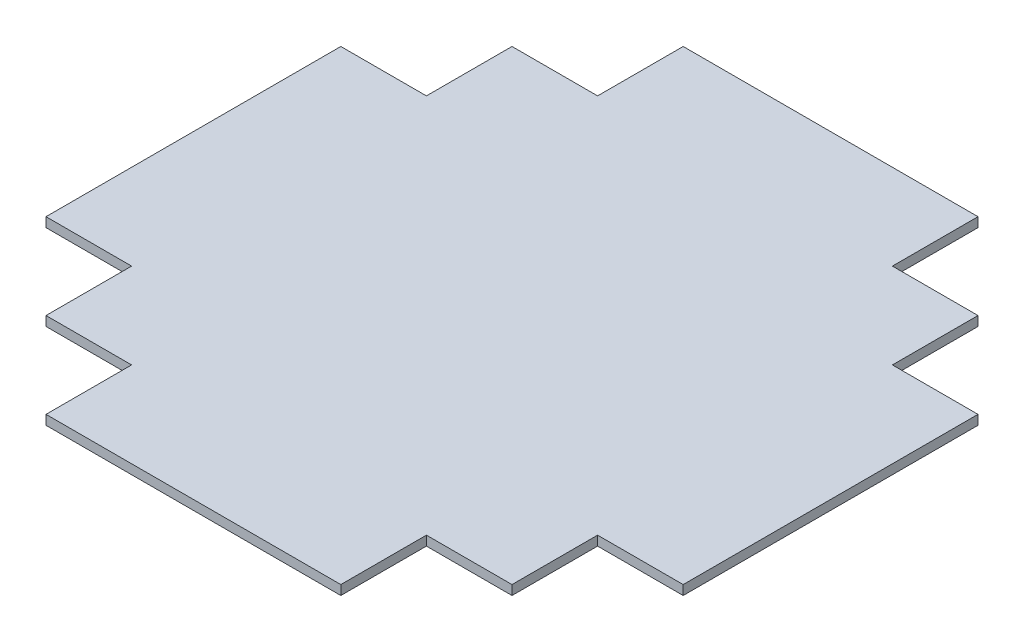
ISO-10303-21;
HEADER;
FILE_DESCRIPTION(('STEP AP214'),'2;1');
FILE_NAME('part.step','',(''),(''),'','','');
FILE_SCHEMA(('AUTOMOTIVE_DESIGN { 1 0 10303 214 1 1 1 1 }'));
ENDSEC;
DATA;
#1=APPLICATION_CONTEXT('core data for automotive mechanical design processes');
#2=APPLICATION_PROTOCOL_DEFINITION('international standard','automotive_design',2000,#1);
#3=PRODUCT_CONTEXT('',#1,'mechanical');
#4=PRODUCT('Part','Part','',(#3));
#5=PRODUCT_RELATED_PRODUCT_CATEGORY('part','',(#4));
#6=PRODUCT_DEFINITION_FORMATION('','',#4);
#7=PRODUCT_DEFINITION_CONTEXT('part definition',#1,'design');
#8=PRODUCT_DEFINITION('design','',#6,#7);
#9=PRODUCT_DEFINITION_SHAPE('','',#8);
#10=(LENGTH_UNIT() NAMED_UNIT(*) SI_UNIT(.MILLI.,.METRE.));
#11=(NAMED_UNIT(*) PLANE_ANGLE_UNIT() SI_UNIT($,.RADIAN.));
#12=(NAMED_UNIT(*) SI_UNIT($,.STERADIAN.) SOLID_ANGLE_UNIT());
#13=UNCERTAINTY_MEASURE_WITH_UNIT(LENGTH_MEASURE(1.E-05),#10,'distance_accuracy_value','');
#14=(GEOMETRIC_REPRESENTATION_CONTEXT(3) GLOBAL_UNCERTAINTY_ASSIGNED_CONTEXT((#13)) GLOBAL_UNIT_ASSIGNED_CONTEXT((#10,
#11,#12)) REPRESENTATION_CONTEXT('',''));
#15=CARTESIAN_POINT('',(0.,0.,0.));
#16=DIRECTION('',(0.,0.,1.));
#17=DIRECTION('',(1.,0.,0.));
#18=AXIS2_PLACEMENT_3D('',#15,#16,#17);
#19=CARTESIAN_POINT('',(-62.,2.,0.));
#20=DIRECTION('',(0.,0.,1.));
#21=DIRECTION('',(1.,0.,0.));
#22=AXIS2_PLACEMENT_3D('',#19,#20,#21);
#23=PLANE('',#22);
#24=DIRECTION('',(-1.,0.,0.));
#25=VECTOR('',#24,1.);
#26=CARTESIAN_POINT('',(-62.,0.,0.));
#27=LINE('',#26,#25);
#28=CARTESIAN_POINT('',(0.,0.,0.));
#29=VERTEX_POINT('',#28);
#30=CARTESIAN_POINT('',(-62.,0.,0.));
#31=VERTEX_POINT('',#30);
#32=EDGE_CURVE('E214',#29,#31,#27,.T.);
#33=ORIENTED_EDGE('',*,*,#32,.T.);
#34=DIRECTION('',(0.,-1.,0.));
#35=VECTOR('',#34,1.);
#36=CARTESIAN_POINT('',(-62.,2.,0.));
#37=LINE('',#36,#35);
#38=CARTESIAN_POINT('',(-62.,2.,0.));
#39=VERTEX_POINT('',#38);
#40=EDGE_CURVE('E11',#39,#31,#37,.T.);
#41=ORIENTED_EDGE('',*,*,#40,.F.);
#42=DIRECTION('',(-1.,0.,0.));
#43=VECTOR('',#42,1.);
#44=CARTESIAN_POINT('',(-62.,2.,0.));
#45=LINE('',#44,#43);
#46=CARTESIAN_POINT('',(0.,2.,0.));
#47=VERTEX_POINT('',#46);
#48=EDGE_CURVE('E272',#47,#39,#45,.T.);
#49=ORIENTED_EDGE('',*,*,#48,.F.);
#50=DIRECTION('',(0.,-1.,0.));
#51=VECTOR('',#50,1.);
#52=CARTESIAN_POINT('',(0.,2.,0.));
#53=LINE('',#52,#51);
#54=EDGE_CURVE('E210',#47,#29,#53,.T.);
#55=ORIENTED_EDGE('',*,*,#54,.T.);
#56=EDGE_LOOP('',(#33,#41,#49,#55));
#57=FACE_BOUND('',#56,.T.);
#58=ADVANCED_FACE('F41',(#57),#23,.F.);
#59=CARTESIAN_POINT('',(-62.,2.,0.));
#60=DIRECTION('',(1.,0.,0.));
#61=DIRECTION('',(0.,0.,-1.));
#62=AXIS2_PLACEMENT_3D('',#59,#60,#61);
#63=PLANE('',#62);
#64=DIRECTION('',(0.,0.,1.));
#65=VECTOR('',#64,1.);
#66=CARTESIAN_POINT('',(-62.,0.,0.));
#67=LINE('',#66,#65);
#68=CARTESIAN_POINT('',(-62.,0.,18.));
#69=VERTEX_POINT('',#68);
#70=EDGE_CURVE('E218',#31,#69,#67,.T.);
#71=ORIENTED_EDGE('',*,*,#70,.T.);
#72=DIRECTION('',(0.,-1.,0.));
#73=VECTOR('',#72,1.);
#74=CARTESIAN_POINT('',(-62.,2.,18.));
#75=LINE('',#74,#73);
#76=CARTESIAN_POINT('',(-62.,2.,18.));
#77=VERTEX_POINT('',#76);
#78=EDGE_CURVE('E50',#77,#69,#75,.T.);
#79=ORIENTED_EDGE('',*,*,#78,.F.);
#80=DIRECTION('',(0.,0.,1.));
#81=VECTOR('',#80,1.);
#82=CARTESIAN_POINT('',(-62.,2.,0.));
#83=LINE('',#82,#81);
#84=EDGE_CURVE('E137',#39,#77,#83,.T.);
#85=ORIENTED_EDGE('',*,*,#84,.F.);
#86=ORIENTED_EDGE('',*,*,#40,.T.);
#87=EDGE_LOOP('',(#71,#79,#85,#86));
#88=FACE_BOUND('',#87,.T.);
#89=ADVANCED_FACE('F422',(#88),#63,.F.);
#90=CARTESIAN_POINT('',(-62.,2.,18.));
#91=DIRECTION('',(0.,0.,1.));
#92=DIRECTION('',(1.,0.,0.));
#93=AXIS2_PLACEMENT_3D('',#90,#91,#92);
#94=PLANE('',#93);
#95=DIRECTION('',(-1.,0.,0.));
#96=VECTOR('',#95,1.);
#97=CARTESIAN_POINT('',(-62.,0.,18.));
#98=LINE('',#97,#96);
#99=CARTESIAN_POINT('',(-80.,0.,18.));
#100=VERTEX_POINT('',#99);
#101=EDGE_CURVE('E221',#69,#100,#98,.T.);
#102=ORIENTED_EDGE('',*,*,#101,.T.);
#103=DIRECTION('',(0.,-1.,0.));
#104=VECTOR('',#103,1.);
#105=CARTESIAN_POINT('',(-80.,2.,18.));
#106=LINE('',#105,#104);
#107=CARTESIAN_POINT('',(-80.,2.,18.));
#108=VERTEX_POINT('',#107);
#109=EDGE_CURVE('E331',#108,#100,#106,.T.);
#110=ORIENTED_EDGE('',*,*,#109,.F.);
#111=DIRECTION('',(-1.,0.,0.));
#112=VECTOR('',#111,1.);
#113=CARTESIAN_POINT('',(-62.,2.,18.));
#114=LINE('',#113,#112);
#115=EDGE_CURVE('E341',#77,#108,#114,.T.);
#116=ORIENTED_EDGE('',*,*,#115,.F.);
#117=ORIENTED_EDGE('',*,*,#78,.T.);
#118=EDGE_LOOP('',(#102,#110,#116,#117));
#119=FACE_BOUND('',#118,.T.);
#120=ADVANCED_FACE('F339',(#119),#94,.F.);
#121=CARTESIAN_POINT('',(-80.,2.,18.));
#122=DIRECTION('',(1.,0.,0.));
#123=DIRECTION('',(0.,0.,-1.));
#124=AXIS2_PLACEMENT_3D('',#121,#122,#123);
#125=PLANE('',#124);
#126=DIRECTION('',(0.,0.,1.));
#127=VECTOR('',#126,1.);
#128=CARTESIAN_POINT('',(-80.,0.,18.));
#129=LINE('',#128,#127);
#130=CARTESIAN_POINT('',(-80.,0.,36.));
#131=VERTEX_POINT('',#130);
#132=EDGE_CURVE('E224',#100,#131,#129,.T.);
#133=ORIENTED_EDGE('',*,*,#132,.T.);
#134=DIRECTION('',(0.,-1.,0.));
#135=VECTOR('',#134,1.);
#136=CARTESIAN_POINT('',(-80.,2.,36.));
#137=LINE('',#136,#135);
#138=CARTESIAN_POINT('',(-80.,2.,36.));
#139=VERTEX_POINT('',#138);
#140=EDGE_CURVE('E327',#139,#131,#137,.T.);
#141=ORIENTED_EDGE('',*,*,#140,.F.);
#142=DIRECTION('',(0.,0.,1.));
#143=VECTOR('',#142,1.);
#144=CARTESIAN_POINT('',(-80.,2.,18.));
#145=LINE('',#144,#143);
#146=EDGE_CURVE('E360',#108,#139,#145,.T.);
#147=ORIENTED_EDGE('',*,*,#146,.F.);
#148=ORIENTED_EDGE('',*,*,#109,.T.);
#149=EDGE_LOOP('',(#133,#141,#147,#148));
#150=FACE_BOUND('',#149,.T.);
#151=ADVANCED_FACE('F350',(#150),#125,.F.);
#152=CARTESIAN_POINT('',(-80.,2.,36.));
#153=DIRECTION('',(0.,0.,1.));
#154=DIRECTION('',(1.,0.,0.));
#155=AXIS2_PLACEMENT_3D('',#152,#153,#154);
#156=PLANE('',#155);
#157=DIRECTION('',(-1.,0.,0.));
#158=VECTOR('',#157,1.);
#159=CARTESIAN_POINT('',(-80.,0.,36.));
#160=LINE('',#159,#158);
#161=CARTESIAN_POINT('',(-98.,0.,36.));
#162=VERTEX_POINT('',#161);
#163=EDGE_CURVE('E227',#131,#162,#160,.T.);
#164=ORIENTED_EDGE('',*,*,#163,.T.);
#165=DIRECTION('',(0.,-1.,0.));
#166=VECTOR('',#165,1.);
#167=CARTESIAN_POINT('',(-98.,2.,36.));
#168=LINE('',#167,#166);
#169=CARTESIAN_POINT('',(-98.,2.,36.));
#170=VERTEX_POINT('',#169);
#171=EDGE_CURVE('E323',#170,#162,#168,.T.);
#172=ORIENTED_EDGE('',*,*,#171,.F.);
#173=DIRECTION('',(-1.,0.,0.));
#174=VECTOR('',#173,1.);
#175=CARTESIAN_POINT('',(-80.,2.,36.));
#176=LINE('',#175,#174);
#177=EDGE_CURVE('E356',#139,#170,#176,.T.);
#178=ORIENTED_EDGE('',*,*,#177,.F.);
#179=ORIENTED_EDGE('',*,*,#140,.T.);
#180=EDGE_LOOP('',(#164,#172,#178,#179));
#181=FACE_BOUND('',#180,.T.);
#182=ADVANCED_FACE('F354',(#181),#156,.F.);
#183=CARTESIAN_POINT('',(-98.,2.,36.));
#184=DIRECTION('',(1.,0.,0.));
#185=DIRECTION('',(0.,0.,-1.));
#186=AXIS2_PLACEMENT_3D('',#183,#184,#185);
#187=PLANE('',#186);
#188=DIRECTION('',(0.,0.,1.));
#189=VECTOR('',#188,1.);
#190=CARTESIAN_POINT('',(-98.,0.,36.));
#191=LINE('',#190,#189);
#192=CARTESIAN_POINT('',(-98.,0.,98.));
#193=VERTEX_POINT('',#192);
#194=EDGE_CURVE('E230',#162,#193,#191,.T.);
#195=ORIENTED_EDGE('',*,*,#194,.T.);
#196=DIRECTION('',(0.,-1.,0.));
#197=VECTOR('',#196,1.);
#198=CARTESIAN_POINT('',(-98.,2.,98.));
#199=LINE('',#198,#197);
#200=CARTESIAN_POINT('',(-98.,2.,98.));
#201=VERTEX_POINT('',#200);
#202=EDGE_CURVE('E319',#201,#193,#199,.T.);
#203=ORIENTED_EDGE('',*,*,#202,.F.);
#204=DIRECTION('',(0.,0.,1.));
#205=VECTOR('',#204,1.);
#206=CARTESIAN_POINT('',(-98.,2.,36.));
#207=LINE('',#206,#205);
#208=EDGE_CURVE('E359',#170,#201,#207,.T.);
#209=ORIENTED_EDGE('',*,*,#208,.F.);
#210=ORIENTED_EDGE('',*,*,#171,.T.);
#211=EDGE_LOOP('',(#195,#203,#209,#210));
#212=FACE_BOUND('',#211,.T.);
#213=ADVANCED_FACE('F435',(#212),#187,.F.);
#214=CARTESIAN_POINT('',(-98.,2.,98.));
#215=DIRECTION('',(0.,0.,-1.));
#216=DIRECTION('',(-1.,0.,0.));
#217=AXIS2_PLACEMENT_3D('',#214,#215,#216);
#218=PLANE('',#217);
#219=DIRECTION('',(1.,0.,0.));
#220=VECTOR('',#219,1.);
#221=CARTESIAN_POINT('',(-98.,0.,98.));
#222=LINE('',#221,#220);
#223=CARTESIAN_POINT('',(-80.,0.,98.));
#224=VERTEX_POINT('',#223);
#225=EDGE_CURVE('E233',#193,#224,#222,.T.);
#226=ORIENTED_EDGE('',*,*,#225,.T.);
#227=DIRECTION('',(0.,-1.,0.));
#228=VECTOR('',#227,1.);
#229=CARTESIAN_POINT('',(-80.,2.,98.));
#230=LINE('',#229,#228);
#231=CARTESIAN_POINT('',(-80.,2.,98.));
#232=VERTEX_POINT('',#231);
#233=EDGE_CURVE('E315',#232,#224,#230,.T.);
#234=ORIENTED_EDGE('',*,*,#233,.F.);
#235=DIRECTION('',(1.,0.,0.));
#236=VECTOR('',#235,1.);
#237=CARTESIAN_POINT('',(-98.,2.,98.));
#238=LINE('',#237,#236);
#239=EDGE_CURVE('E364',#201,#232,#238,.T.);
#240=ORIENTED_EDGE('',*,*,#239,.F.);
#241=ORIENTED_EDGE('',*,*,#202,.T.);
#242=EDGE_LOOP('',(#226,#234,#240,#241));
#243=FACE_BOUND('',#242,.T.);
#244=ADVANCED_FACE('F438',(#243),#218,.F.);
#245=CARTESIAN_POINT('',(-80.,2.,98.));
#246=DIRECTION('',(1.,0.,0.));
#247=DIRECTION('',(0.,0.,-1.));
#248=AXIS2_PLACEMENT_3D('',#245,#246,#247);
#249=PLANE('',#248);
#250=DIRECTION('',(0.,0.,1.));
#251=VECTOR('',#250,1.);
#252=CARTESIAN_POINT('',(-80.,0.,98.));
#253=LINE('',#252,#251);
#254=CARTESIAN_POINT('',(-80.,0.,116.));
#255=VERTEX_POINT('',#254);
#256=EDGE_CURVE('E236',#224,#255,#253,.T.);
#257=ORIENTED_EDGE('',*,*,#256,.T.);
#258=DIRECTION('',(0.,-1.,0.));
#259=VECTOR('',#258,1.);
#260=CARTESIAN_POINT('',(-80.,2.,116.));
#261=LINE('',#260,#259);
#262=CARTESIAN_POINT('',(-80.,2.,116.));
#263=VERTEX_POINT('',#262);
#264=EDGE_CURVE('E311',#263,#255,#261,.T.);
#265=ORIENTED_EDGE('',*,*,#264,.F.);
#266=DIRECTION('',(0.,0.,1.));
#267=VECTOR('',#266,1.);
#268=CARTESIAN_POINT('',(-80.,2.,98.));
#269=LINE('',#268,#267);
#270=EDGE_CURVE('E371',#232,#263,#269,.T.);
#271=ORIENTED_EDGE('',*,*,#270,.F.);
#272=ORIENTED_EDGE('',*,*,#233,.T.);
#273=EDGE_LOOP('',(#257,#265,#271,#272));
#274=FACE_BOUND('',#273,.T.);
#275=ADVANCED_FACE('F442',(#274),#249,.F.);
#276=CARTESIAN_POINT('',(-80.,2.,116.));
#277=DIRECTION('',(0.,0.,-1.));
#278=DIRECTION('',(-1.,0.,0.));
#279=AXIS2_PLACEMENT_3D('',#276,#277,#278);
#280=PLANE('',#279);
#281=DIRECTION('',(1.,0.,0.));
#282=VECTOR('',#281,1.);
#283=CARTESIAN_POINT('',(-80.,0.,116.));
#284=LINE('',#283,#282);
#285=CARTESIAN_POINT('',(-62.,0.,116.));
#286=VERTEX_POINT('',#285);
#287=EDGE_CURVE('E239',#255,#286,#284,.T.);
#288=ORIENTED_EDGE('',*,*,#287,.T.);
#289=DIRECTION('',(0.,-1.,0.));
#290=VECTOR('',#289,1.);
#291=CARTESIAN_POINT('',(-62.,2.,116.));
#292=LINE('',#291,#290);
#293=CARTESIAN_POINT('',(-62.,2.,116.));
#294=VERTEX_POINT('',#293);
#295=EDGE_CURVE('E307',#294,#286,#292,.T.);
#296=ORIENTED_EDGE('',*,*,#295,.F.);
#297=DIRECTION('',(1.,0.,0.));
#298=VECTOR('',#297,1.);
#299=CARTESIAN_POINT('',(-80.,2.,116.));
#300=LINE('',#299,#298);
#301=EDGE_CURVE('E374',#263,#294,#300,.T.);
#302=ORIENTED_EDGE('',*,*,#301,.F.);
#303=ORIENTED_EDGE('',*,*,#264,.T.);
#304=EDGE_LOOP('',(#288,#296,#302,#303));
#305=FACE_BOUND('',#304,.T.);
#306=ADVANCED_FACE('F446',(#305),#280,.F.);
#307=CARTESIAN_POINT('',(-62.,2.,116.));
#308=DIRECTION('',(1.,0.,0.));
#309=DIRECTION('',(0.,0.,-1.));
#310=AXIS2_PLACEMENT_3D('',#307,#308,#309);
#311=PLANE('',#310);
#312=DIRECTION('',(0.,0.,1.));
#313=VECTOR('',#312,1.);
#314=CARTESIAN_POINT('',(-62.,0.,116.));
#315=LINE('',#314,#313);
#316=CARTESIAN_POINT('',(-62.,0.,134.));
#317=VERTEX_POINT('',#316);
#318=EDGE_CURVE('E242',#286,#317,#315,.T.);
#319=ORIENTED_EDGE('',*,*,#318,.T.);
#320=DIRECTION('',(0.,-1.,0.));
#321=VECTOR('',#320,1.);
#322=CARTESIAN_POINT('',(-62.,2.,134.));
#323=LINE('',#322,#321);
#324=CARTESIAN_POINT('',(-62.,2.,134.));
#325=VERTEX_POINT('',#324);
#326=EDGE_CURVE('E303',#325,#317,#323,.T.);
#327=ORIENTED_EDGE('',*,*,#326,.F.);
#328=DIRECTION('',(0.,0.,1.));
#329=VECTOR('',#328,1.);
#330=CARTESIAN_POINT('',(-62.,2.,116.));
#331=LINE('',#330,#329);
#332=EDGE_CURVE('E377',#294,#325,#331,.T.);
#333=ORIENTED_EDGE('',*,*,#332,.F.);
#334=ORIENTED_EDGE('',*,*,#295,.T.);
#335=EDGE_LOOP('',(#319,#327,#333,#334));
#336=FACE_BOUND('',#335,.T.);
#337=ADVANCED_FACE('F450',(#336),#311,.F.);
#338=CARTESIAN_POINT('',(-62.,2.,134.));
#339=DIRECTION('',(0.,0.,-1.));
#340=DIRECTION('',(-1.,0.,0.));
#341=AXIS2_PLACEMENT_3D('',#338,#339,#340);
#342=PLANE('',#341);
#343=DIRECTION('',(1.,0.,0.));
#344=VECTOR('',#343,1.);
#345=CARTESIAN_POINT('',(-62.,0.,134.));
#346=LINE('',#345,#344);
#347=CARTESIAN_POINT('',(0.,0.,134.));
#348=VERTEX_POINT('',#347);
#349=EDGE_CURVE('E245',#317,#348,#346,.T.);
#350=ORIENTED_EDGE('',*,*,#349,.T.);
#351=DIRECTION('',(0.,-1.,0.));
#352=VECTOR('',#351,1.);
#353=CARTESIAN_POINT('',(0.,2.,134.));
#354=LINE('',#353,#352);
#355=CARTESIAN_POINT('',(0.,2.,134.));
#356=VERTEX_POINT('',#355);
#357=EDGE_CURVE('E299',#356,#348,#354,.T.);
#358=ORIENTED_EDGE('',*,*,#357,.F.);
#359=DIRECTION('',(1.,0.,0.));
#360=VECTOR('',#359,1.);
#361=CARTESIAN_POINT('',(-62.,2.,134.));
#362=LINE('',#361,#360);
#363=EDGE_CURVE('E380',#325,#356,#362,.T.);
#364=ORIENTED_EDGE('',*,*,#363,.F.);
#365=ORIENTED_EDGE('',*,*,#326,.T.);
#366=EDGE_LOOP('',(#350,#358,#364,#365));
#367=FACE_BOUND('',#366,.T.);
#368=ADVANCED_FACE('F454',(#367),#342,.F.);
#369=CARTESIAN_POINT('',(0.,2.,134.));
#370=DIRECTION('',(-1.,0.,0.));
#371=DIRECTION('',(0.,0.,1.));
#372=AXIS2_PLACEMENT_3D('',#369,#370,#371);
#373=PLANE('',#372);
#374=DIRECTION('',(0.,0.,-1.));
#375=VECTOR('',#374,1.);
#376=CARTESIAN_POINT('',(0.,0.,134.));
#377=LINE('',#376,#375);
#378=CARTESIAN_POINT('',(0.,0.,116.));
#379=VERTEX_POINT('',#378);
#380=EDGE_CURVE('E248',#348,#379,#377,.T.);
#381=ORIENTED_EDGE('',*,*,#380,.T.);
#382=DIRECTION('',(0.,-1.,0.));
#383=VECTOR('',#382,1.);
#384=CARTESIAN_POINT('',(0.,2.,116.));
#385=LINE('',#384,#383);
#386=CARTESIAN_POINT('',(0.,2.,116.));
#387=VERTEX_POINT('',#386);
#388=EDGE_CURVE('E295',#387,#379,#385,.T.);
#389=ORIENTED_EDGE('',*,*,#388,.F.);
#390=DIRECTION('',(0.,0.,-1.));
#391=VECTOR('',#390,1.);
#392=CARTESIAN_POINT('',(0.,2.,134.));
#393=LINE('',#392,#391);
#394=EDGE_CURVE('E383',#356,#387,#393,.T.);
#395=ORIENTED_EDGE('',*,*,#394,.F.);
#396=ORIENTED_EDGE('',*,*,#357,.T.);
#397=EDGE_LOOP('',(#381,#389,#395,#396));
#398=FACE_BOUND('',#397,.T.);
#399=ADVANCED_FACE('F458',(#398),#373,.F.);
#400=CARTESIAN_POINT('',(0.,2.,116.));
#401=DIRECTION('',(0.,0.,-1.));
#402=DIRECTION('',(-1.,0.,0.));
#403=AXIS2_PLACEMENT_3D('',#400,#401,#402);
#404=PLANE('',#403);
#405=DIRECTION('',(1.,0.,0.));
#406=VECTOR('',#405,1.);
#407=CARTESIAN_POINT('',(0.,0.,116.));
#408=LINE('',#407,#406);
#409=CARTESIAN_POINT('',(18.,0.,116.));
#410=VERTEX_POINT('',#409);
#411=EDGE_CURVE('E251',#379,#410,#408,.T.);
#412=ORIENTED_EDGE('',*,*,#411,.T.);
#413=DIRECTION('',(0.,-1.,0.));
#414=VECTOR('',#413,1.);
#415=CARTESIAN_POINT('',(18.,2.,116.));
#416=LINE('',#415,#414);
#417=CARTESIAN_POINT('',(18.,2.,116.));
#418=VERTEX_POINT('',#417);
#419=EDGE_CURVE('E291',#418,#410,#416,.T.);
#420=ORIENTED_EDGE('',*,*,#419,.F.);
#421=DIRECTION('',(1.,0.,0.));
#422=VECTOR('',#421,1.);
#423=CARTESIAN_POINT('',(0.,2.,116.));
#424=LINE('',#423,#422);
#425=EDGE_CURVE('E386',#387,#418,#424,.T.);
#426=ORIENTED_EDGE('',*,*,#425,.F.);
#427=ORIENTED_EDGE('',*,*,#388,.T.);
#428=EDGE_LOOP('',(#412,#420,#426,#427));
#429=FACE_BOUND('',#428,.T.);
#430=ADVANCED_FACE('F462',(#429),#404,.F.);
#431=CARTESIAN_POINT('',(18.,2.,116.));
#432=DIRECTION('',(-1.,0.,0.));
#433=DIRECTION('',(0.,0.,1.));
#434=AXIS2_PLACEMENT_3D('',#431,#432,#433);
#435=PLANE('',#434);
#436=DIRECTION('',(0.,0.,-1.));
#437=VECTOR('',#436,1.);
#438=CARTESIAN_POINT('',(18.,0.,116.));
#439=LINE('',#438,#437);
#440=CARTESIAN_POINT('',(18.,0.,98.));
#441=VERTEX_POINT('',#440);
#442=EDGE_CURVE('E254',#410,#441,#439,.T.);
#443=ORIENTED_EDGE('',*,*,#442,.T.);
#444=DIRECTION('',(0.,-1.,0.));
#445=VECTOR('',#444,1.);
#446=CARTESIAN_POINT('',(18.,2.,98.));
#447=LINE('',#446,#445);
#448=CARTESIAN_POINT('',(18.,2.,98.));
#449=VERTEX_POINT('',#448);
#450=EDGE_CURVE('E287',#449,#441,#447,.T.);
#451=ORIENTED_EDGE('',*,*,#450,.F.);
#452=DIRECTION('',(0.,0.,-1.));
#453=VECTOR('',#452,1.);
#454=CARTESIAN_POINT('',(18.,2.,116.));
#455=LINE('',#454,#453);
#456=EDGE_CURVE('E389',#418,#449,#455,.T.);
#457=ORIENTED_EDGE('',*,*,#456,.F.);
#458=ORIENTED_EDGE('',*,*,#419,.T.);
#459=EDGE_LOOP('',(#443,#451,#457,#458));
#460=FACE_BOUND('',#459,.T.);
#461=ADVANCED_FACE('F466',(#460),#435,.F.);
#462=CARTESIAN_POINT('',(18.,2.,98.));
#463=DIRECTION('',(0.,0.,-1.));
#464=DIRECTION('',(-1.,0.,0.));
#465=AXIS2_PLACEMENT_3D('',#462,#463,#464);
#466=PLANE('',#465);
#467=DIRECTION('',(1.,0.,0.));
#468=VECTOR('',#467,1.);
#469=CARTESIAN_POINT('',(18.,0.,98.));
#470=LINE('',#469,#468);
#471=CARTESIAN_POINT('',(36.,0.,98.));
#472=VERTEX_POINT('',#471);
#473=EDGE_CURVE('E257',#441,#472,#470,.T.);
#474=ORIENTED_EDGE('',*,*,#473,.T.);
#475=DIRECTION('',(0.,-1.,0.));
#476=VECTOR('',#475,1.);
#477=CARTESIAN_POINT('',(36.,2.,98.));
#478=LINE('',#477,#476);
#479=CARTESIAN_POINT('',(36.,2.,98.));
#480=VERTEX_POINT('',#479);
#481=EDGE_CURVE('E283',#480,#472,#478,.T.);
#482=ORIENTED_EDGE('',*,*,#481,.F.);
#483=DIRECTION('',(1.,0.,0.));
#484=VECTOR('',#483,1.);
#485=CARTESIAN_POINT('',(18.,2.,98.));
#486=LINE('',#485,#484);
#487=EDGE_CURVE('E392',#449,#480,#486,.T.);
#488=ORIENTED_EDGE('',*,*,#487,.F.);
#489=ORIENTED_EDGE('',*,*,#450,.T.);
#490=EDGE_LOOP('',(#474,#482,#488,#489));
#491=FACE_BOUND('',#490,.T.);
#492=ADVANCED_FACE('F470',(#491),#466,.F.);
#493=CARTESIAN_POINT('',(36.,2.,98.));
#494=DIRECTION('',(-1.,0.,0.));
#495=DIRECTION('',(0.,0.,1.));
#496=AXIS2_PLACEMENT_3D('',#493,#494,#495);
#497=PLANE('',#496);
#498=DIRECTION('',(0.,0.,-1.));
#499=VECTOR('',#498,1.);
#500=CARTESIAN_POINT('',(36.,0.,98.));
#501=LINE('',#500,#499);
#502=CARTESIAN_POINT('',(36.,0.,36.));
#503=VERTEX_POINT('',#502);
#504=EDGE_CURVE('E260',#472,#503,#501,.T.);
#505=ORIENTED_EDGE('',*,*,#504,.T.);
#506=DIRECTION('',(0.,-1.,0.));
#507=VECTOR('',#506,1.);
#508=CARTESIAN_POINT('',(36.,2.,36.));
#509=LINE('',#508,#507);
#510=CARTESIAN_POINT('',(36.,2.,36.));
#511=VERTEX_POINT('',#510);
#512=EDGE_CURVE('E279',#511,#503,#509,.T.);
#513=ORIENTED_EDGE('',*,*,#512,.F.);
#514=DIRECTION('',(0.,0.,-1.));
#515=VECTOR('',#514,1.);
#516=CARTESIAN_POINT('',(36.,2.,98.));
#517=LINE('',#516,#515);
#518=EDGE_CURVE('E395',#480,#511,#517,.T.);
#519=ORIENTED_EDGE('',*,*,#518,.F.);
#520=ORIENTED_EDGE('',*,*,#481,.T.);
#521=EDGE_LOOP('',(#505,#513,#519,#520));
#522=FACE_BOUND('',#521,.T.);
#523=ADVANCED_FACE('F403',(#522),#497,.F.);
#524=CARTESIAN_POINT('',(18.,2.,36.));
#525=DIRECTION('',(0.,0.,1.));
#526=DIRECTION('',(1.,0.,0.));
#527=AXIS2_PLACEMENT_3D('',#524,#525,#526);
#528=PLANE('',#527);
#529=DIRECTION('',(-1.,0.,0.));
#530=VECTOR('',#529,1.);
#531=CARTESIAN_POINT('',(18.,0.,36.));
#532=LINE('',#531,#530);
#533=CARTESIAN_POINT('',(18.,0.,36.));
#534=VERTEX_POINT('',#533);
#535=EDGE_CURVE('E263',#503,#534,#532,.T.);
#536=ORIENTED_EDGE('',*,*,#535,.T.);
#537=DIRECTION('',(0.,-1.,0.));
#538=VECTOR('',#537,1.);
#539=CARTESIAN_POINT('',(18.,2.,36.));
#540=LINE('',#539,#538);
#541=CARTESIAN_POINT('',(18.,2.,36.));
#542=VERTEX_POINT('',#541);
#543=EDGE_CURVE('E203',#542,#534,#540,.T.);
#544=ORIENTED_EDGE('',*,*,#543,.F.);
#545=DIRECTION('',(-1.,0.,0.));
#546=VECTOR('',#545,1.);
#547=CARTESIAN_POINT('',(18.,2.,36.));
#548=LINE('',#547,#546);
#549=EDGE_CURVE('E192',#511,#542,#548,.T.);
#550=ORIENTED_EDGE('',*,*,#549,.F.);
#551=ORIENTED_EDGE('',*,*,#512,.T.);
#552=EDGE_LOOP('',(#536,#544,#550,#551));
#553=FACE_BOUND('',#552,.T.);
#554=ADVANCED_FACE('F407',(#553),#528,.F.);
#555=CARTESIAN_POINT('',(18.,2.,36.));
#556=DIRECTION('',(-1.,0.,0.));
#557=DIRECTION('',(0.,0.,1.));
#558=AXIS2_PLACEMENT_3D('',#555,#556,#557);
#559=PLANE('',#558);
#560=DIRECTION('',(0.,0.,-1.));
#561=VECTOR('',#560,1.);
#562=CARTESIAN_POINT('',(18.,0.,36.));
#563=LINE('',#562,#561);
#564=CARTESIAN_POINT('',(18.,0.,18.));
#565=VERTEX_POINT('',#564);
#566=EDGE_CURVE('E201',#534,#565,#563,.T.);
#567=ORIENTED_EDGE('',*,*,#566,.T.);
#568=DIRECTION('',(0.,-1.,0.));
#569=VECTOR('',#568,1.);
#570=CARTESIAN_POINT('',(18.,2.,18.));
#571=LINE('',#570,#569);
#572=CARTESIAN_POINT('',(18.,2.,18.));
#573=VERTEX_POINT('',#572);
#574=EDGE_CURVE('E198',#573,#565,#571,.T.);
#575=ORIENTED_EDGE('',*,*,#574,.F.);
#576=DIRECTION('',(0.,0.,-1.));
#577=VECTOR('',#576,1.);
#578=CARTESIAN_POINT('',(18.,2.,36.));
#579=LINE('',#578,#577);
#580=EDGE_CURVE('E186',#542,#573,#579,.T.);
#581=ORIENTED_EDGE('',*,*,#580,.F.);
#582=ORIENTED_EDGE('',*,*,#543,.T.);
#583=EDGE_LOOP('',(#567,#575,#581,#582));
#584=FACE_BOUND('',#583,.T.);
#585=ADVANCED_FACE('F199',(#584),#559,.F.);
#586=CARTESIAN_POINT('',(0.,2.,18.));
#587=DIRECTION('',(0.,0.,1.));
#588=DIRECTION('',(1.,0.,0.));
#589=AXIS2_PLACEMENT_3D('',#586,#587,#588);
#590=PLANE('',#589);
#591=DIRECTION('',(-1.,0.,0.));
#592=VECTOR('',#591,1.);
#593=CARTESIAN_POINT('',(0.,0.,18.));
#594=LINE('',#593,#592);
#595=CARTESIAN_POINT('',(0.,0.,18.));
#596=VERTEX_POINT('',#595);
#597=EDGE_CURVE('E123',#565,#596,#594,.T.);
#598=ORIENTED_EDGE('',*,*,#597,.T.);
#599=DIRECTION('',(0.,-1.,0.));
#600=VECTOR('',#599,1.);
#601=CARTESIAN_POINT('',(0.,2.,18.));
#602=LINE('',#601,#600);
#603=CARTESIAN_POINT('',(0.,2.,18.));
#604=VERTEX_POINT('',#603);
#605=EDGE_CURVE('E204',#604,#596,#602,.T.);
#606=ORIENTED_EDGE('',*,*,#605,.F.);
#607=DIRECTION('',(-1.,0.,0.));
#608=VECTOR('',#607,1.);
#609=CARTESIAN_POINT('',(0.,2.,18.));
#610=LINE('',#609,#608);
#611=EDGE_CURVE('E190',#573,#604,#610,.T.);
#612=ORIENTED_EDGE('',*,*,#611,.F.);
#613=ORIENTED_EDGE('',*,*,#574,.T.);
#614=EDGE_LOOP('',(#598,#606,#612,#613));
#615=FACE_BOUND('',#614,.T.);
#616=ADVANCED_FACE('F206',(#615),#590,.F.);
#617=CARTESIAN_POINT('',(0.,2.,0.));
#618=DIRECTION('',(-1.,0.,0.));
#619=DIRECTION('',(0.,0.,1.));
#620=AXIS2_PLACEMENT_3D('',#617,#618,#619);
#621=PLANE('',#620);
#622=DIRECTION('',(0.,0.,-1.));
#623=VECTOR('',#622,1.);
#624=CARTESIAN_POINT('',(0.,0.,0.));
#625=LINE('',#624,#623);
#626=EDGE_CURVE('E129',#596,#29,#625,.T.);
#627=ORIENTED_EDGE('',*,*,#626,.T.);
#628=ORIENTED_EDGE('',*,*,#54,.F.);
#629=DIRECTION('',(0.,0.,-1.));
#630=VECTOR('',#629,1.);
#631=CARTESIAN_POINT('',(0.,2.,0.));
#632=LINE('',#631,#630);
#633=EDGE_CURVE('E58',#604,#47,#632,.T.);
#634=ORIENTED_EDGE('',*,*,#633,.F.);
#635=ORIENTED_EDGE('',*,*,#605,.T.);
#636=EDGE_LOOP('',(#627,#628,#634,#635));
#637=FACE_BOUND('',#636,.T.);
#638=ADVANCED_FACE('F411',(#637),#621,.F.);
#639=CARTESIAN_POINT('',(0.,2.,0.));
#640=DIRECTION('',(0.,-1.,0.));
#641=DIRECTION('',(0.,0.,-1.));
#642=AXIS2_PLACEMENT_3D('',#639,#640,#641);
#643=PLANE('',#642);
#644=ORIENTED_EDGE('',*,*,#48,.T.);
#645=ORIENTED_EDGE('',*,*,#84,.T.);
#646=ORIENTED_EDGE('',*,*,#115,.T.);
#647=ORIENTED_EDGE('',*,*,#146,.T.);
#648=ORIENTED_EDGE('',*,*,#177,.T.);
#649=ORIENTED_EDGE('',*,*,#208,.T.);
#650=ORIENTED_EDGE('',*,*,#239,.T.);
#651=ORIENTED_EDGE('',*,*,#270,.T.);
#652=ORIENTED_EDGE('',*,*,#301,.T.);
#653=ORIENTED_EDGE('',*,*,#332,.T.);
#654=ORIENTED_EDGE('',*,*,#363,.T.);
#655=ORIENTED_EDGE('',*,*,#394,.T.);
#656=ORIENTED_EDGE('',*,*,#425,.T.);
#657=ORIENTED_EDGE('',*,*,#456,.T.);
#658=ORIENTED_EDGE('',*,*,#487,.T.);
#659=ORIENTED_EDGE('',*,*,#518,.T.);
#660=ORIENTED_EDGE('',*,*,#549,.T.);
#661=ORIENTED_EDGE('',*,*,#580,.T.);
#662=ORIENTED_EDGE('',*,*,#611,.T.);
#663=ORIENTED_EDGE('',*,*,#633,.T.);
#664=EDGE_LOOP('',(#644,#645,#646,#647,#648,#649,#650,#651,#652,#653,#654,#655,#656,#657,#658,
#659,#660,#661,#662,#663));
#665=FACE_BOUND('',#664,.T.);
#666=ADVANCED_FACE('F188',(#665),#643,.F.);
#667=CARTESIAN_POINT('',(0.,0.,0.));
#668=DIRECTION('',(0.,-1.,0.));
#669=DIRECTION('',(0.,0.,-1.));
#670=AXIS2_PLACEMENT_3D('',#667,#668,#669);
#671=PLANE('',#670);
#672=ORIENTED_EDGE('',*,*,#32,.F.);
#673=ORIENTED_EDGE('',*,*,#626,.F.);
#674=ORIENTED_EDGE('',*,*,#597,.F.);
#675=ORIENTED_EDGE('',*,*,#566,.F.);
#676=ORIENTED_EDGE('',*,*,#535,.F.);
#677=ORIENTED_EDGE('',*,*,#504,.F.);
#678=ORIENTED_EDGE('',*,*,#473,.F.);
#679=ORIENTED_EDGE('',*,*,#442,.F.);
#680=ORIENTED_EDGE('',*,*,#411,.F.);
#681=ORIENTED_EDGE('',*,*,#380,.F.);
#682=ORIENTED_EDGE('',*,*,#349,.F.);
#683=ORIENTED_EDGE('',*,*,#318,.F.);
#684=ORIENTED_EDGE('',*,*,#287,.F.);
#685=ORIENTED_EDGE('',*,*,#256,.F.);
#686=ORIENTED_EDGE('',*,*,#225,.F.);
#687=ORIENTED_EDGE('',*,*,#194,.F.);
#688=ORIENTED_EDGE('',*,*,#163,.F.);
#689=ORIENTED_EDGE('',*,*,#132,.F.);
#690=ORIENTED_EDGE('',*,*,#101,.F.);
#691=ORIENTED_EDGE('',*,*,#70,.F.);
#692=EDGE_LOOP('',(#672,#673,#674,#675,#676,#677,#678,#679,#680,#681,#682,#683,#684,#685,#686,
#687,#688,#689,#690,#691));
#693=FACE_BOUND('',#692,.T.);
#694=ADVANCED_FACE('F345',(#693),#671,.T.);
#695=CLOSED_SHELL('',(#58,#89,#120,#151,#182,#213,#244,#275,#306,#337,#368,#399,#430,#461,#492,
#523,#554,#585,#616,#638,#666,#694));
#696=MANIFOLD_SOLID_BREP('B2',#695);
#697=ADVANCED_BREP_SHAPE_REPRESENTATION('',(#18,#696),#14);
#698=SHAPE_DEFINITION_REPRESENTATION(#9,#697);
ENDSEC;
END-ISO-10303-21;
